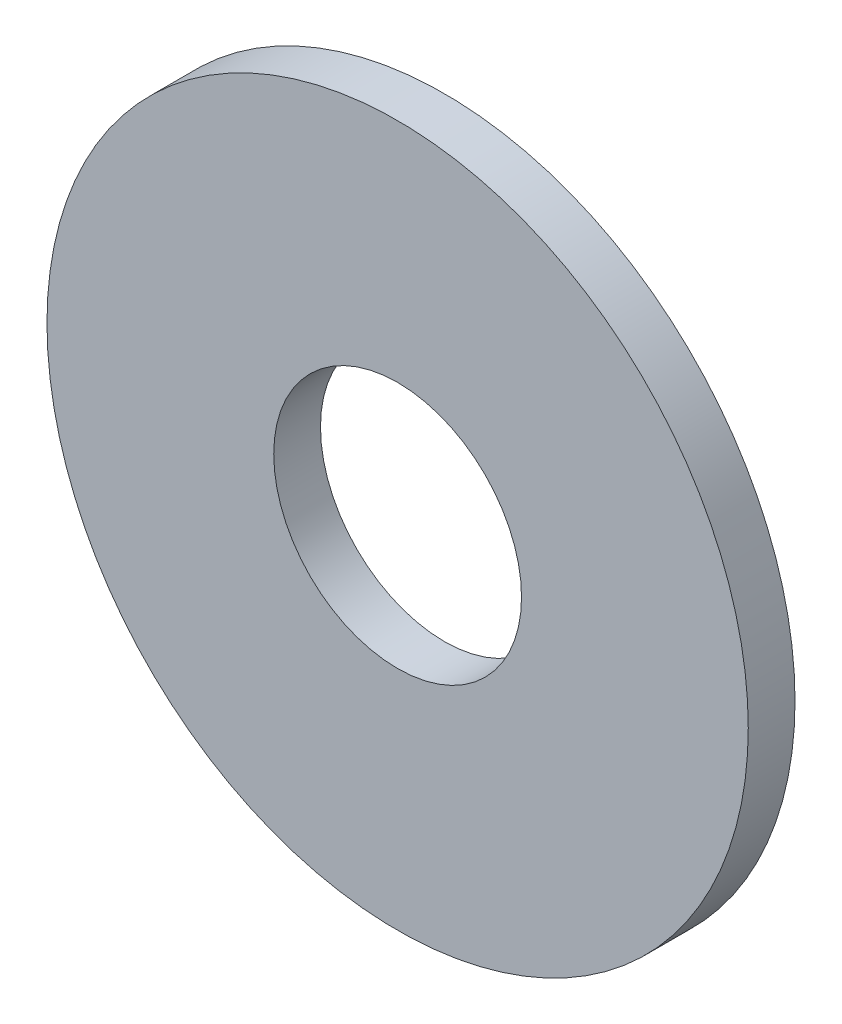
ISO-10303-21;
HEADER;
FILE_DESCRIPTION(('STEP AP214'),'2;1');
FILE_NAME('part.step','',(''),(''),'','','');
FILE_SCHEMA(('AUTOMOTIVE_DESIGN { 1 0 10303 214 1 1 1 1 }'));
ENDSEC;
DATA;
#1=APPLICATION_CONTEXT('core data for automotive mechanical design processes');
#2=APPLICATION_PROTOCOL_DEFINITION('international standard','automotive_design',2000,#1);
#3=PRODUCT_CONTEXT('',#1,'mechanical');
#4=PRODUCT('Part','Part','',(#3));
#5=PRODUCT_RELATED_PRODUCT_CATEGORY('part','',(#4));
#6=PRODUCT_DEFINITION_FORMATION('','',#4);
#7=PRODUCT_DEFINITION_CONTEXT('part definition',#1,'design');
#8=PRODUCT_DEFINITION('design','',#6,#7);
#9=PRODUCT_DEFINITION_SHAPE('','',#8);
#10=(LENGTH_UNIT() NAMED_UNIT(*) SI_UNIT(.MILLI.,.METRE.));
#11=(NAMED_UNIT(*) PLANE_ANGLE_UNIT() SI_UNIT($,.RADIAN.));
#12=(NAMED_UNIT(*) SI_UNIT($,.STERADIAN.) SOLID_ANGLE_UNIT());
#13=UNCERTAINTY_MEASURE_WITH_UNIT(LENGTH_MEASURE(1.E-05),#10,'distance_accuracy_value','');
#14=(GEOMETRIC_REPRESENTATION_CONTEXT(3) GLOBAL_UNCERTAINTY_ASSIGNED_CONTEXT((#13)) GLOBAL_UNIT_ASSIGNED_CONTEXT((#10,
#11,#12)) REPRESENTATION_CONTEXT('',''));
#15=CARTESIAN_POINT('',(0.,0.,0.));
#16=DIRECTION('',(0.,0.,1.));
#17=DIRECTION('',(1.,0.,0.));
#18=AXIS2_PLACEMENT_3D('',#15,#16,#17);
#19=CARTESIAN_POINT('',(0.,0.,-1.));
#20=DIRECTION('',(0.,0.,1.));
#21=DIRECTION('',(1.,0.,0.));
#22=AXIS2_PLACEMENT_3D('',#19,#20,#21);
#23=CYLINDRICAL_SURFACE('',#22,7.5);
#24=CARTESIAN_POINT('',(0.,0.,-1.));
#25=DIRECTION('',(0.,0.,1.));
#26=DIRECTION('',(1.,0.,0.));
#27=AXIS2_PLACEMENT_3D('',#24,#25,#26);
#28=CIRCLE('',#27,7.5);
#29=CARTESIAN_POINT('',(7.5,0.,-1.));
#30=VERTEX_POINT('',#29);
#31=EDGE_CURVE('E10',#30,#30,#28,.T.);
#32=ORIENTED_EDGE('',*,*,#31,.T.);
#33=EDGE_LOOP('',(#32));
#34=FACE_BOUND('',#33,.T.);
#35=CARTESIAN_POINT('',(0.,0.,0.));
#36=DIRECTION('',(0.,0.,1.));
#37=DIRECTION('',(1.,0.,0.));
#38=AXIS2_PLACEMENT_3D('',#35,#36,#37);
#39=CIRCLE('',#38,7.5);
#40=CARTESIAN_POINT('',(7.5,0.,0.));
#41=VERTEX_POINT('',#40);
#42=EDGE_CURVE('E33',#41,#41,#39,.T.);
#43=ORIENTED_EDGE('',*,*,#42,.F.);
#44=EDGE_LOOP('',(#43));
#45=FACE_BOUND('',#44,.T.);
#46=ADVANCED_FACE('F30',(#34,#45),#23,.T.);
#47=CARTESIAN_POINT('',(0.,0.,-1.));
#48=DIRECTION('',(0.,0.,1.));
#49=DIRECTION('',(1.,0.,0.));
#50=AXIS2_PLACEMENT_3D('',#47,#48,#49);
#51=PLANE('',#50);
#52=CARTESIAN_POINT('',(0.,0.,-1.));
#53=DIRECTION('',(0.,0.,1.));
#54=DIRECTION('',(1.,0.,0.));
#55=AXIS2_PLACEMENT_3D('',#52,#53,#54);
#56=CIRCLE('',#55,2.65);
#57=CARTESIAN_POINT('',(2.65,0.,-1.));
#58=VERTEX_POINT('',#57);
#59=EDGE_CURVE('E40',#58,#58,#56,.T.);
#60=ORIENTED_EDGE('',*,*,#59,.T.);
#61=EDGE_LOOP('',(#60));
#62=FACE_BOUND('',#61,.T.);
#63=ORIENTED_EDGE('',*,*,#31,.F.);
#64=EDGE_LOOP('',(#63));
#65=FACE_BOUND('',#64,.T.);
#66=ADVANCED_FACE('F48',(#62,#65),#51,.F.);
#67=CARTESIAN_POINT('',(0.,0.,0.));
#68=DIRECTION('',(0.,0.,1.));
#69=DIRECTION('',(1.,0.,0.));
#70=AXIS2_PLACEMENT_3D('',#67,#68,#69);
#71=PLANE('',#70);
#72=CARTESIAN_POINT('',(0.,0.,0.));
#73=DIRECTION('',(0.,0.,1.));
#74=DIRECTION('',(1.,0.,0.));
#75=AXIS2_PLACEMENT_3D('',#72,#73,#74);
#76=CIRCLE('',#75,2.65);
#77=CARTESIAN_POINT('',(2.65,0.,0.));
#78=VERTEX_POINT('',#77);
#79=EDGE_CURVE('E42',#78,#78,#76,.T.);
#80=ORIENTED_EDGE('',*,*,#79,.F.);
#81=EDGE_LOOP('',(#80));
#82=FACE_BOUND('',#81,.T.);
#83=ORIENTED_EDGE('',*,*,#42,.T.);
#84=EDGE_LOOP('',(#83));
#85=FACE_BOUND('',#84,.T.);
#86=ADVANCED_FACE('F54',(#82,#85),#71,.T.);
#87=CARTESIAN_POINT('',(0.,0.,-1.));
#88=DIRECTION('',(0.,0.,1.));
#89=DIRECTION('',(1.,0.,0.));
#90=AXIS2_PLACEMENT_3D('',#87,#88,#89);
#91=CYLINDRICAL_SURFACE('',#90,2.65);
#92=ORIENTED_EDGE('',*,*,#59,.F.);
#93=EDGE_LOOP('',(#92));
#94=FACE_BOUND('',#93,.T.);
#95=ORIENTED_EDGE('',*,*,#79,.T.);
#96=EDGE_LOOP('',(#95));
#97=FACE_BOUND('',#96,.T.);
#98=ADVANCED_FACE('F51',(#94,#97),#91,.F.);
#99=CLOSED_SHELL('',(#46,#66,#86,#98));
#100=MANIFOLD_SOLID_BREP('B2',#99);
#101=ADVANCED_BREP_SHAPE_REPRESENTATION('',(#18,#100),#14);
#102=SHAPE_DEFINITION_REPRESENTATION(#9,#101);
ENDSEC;
END-ISO-10303-21;
